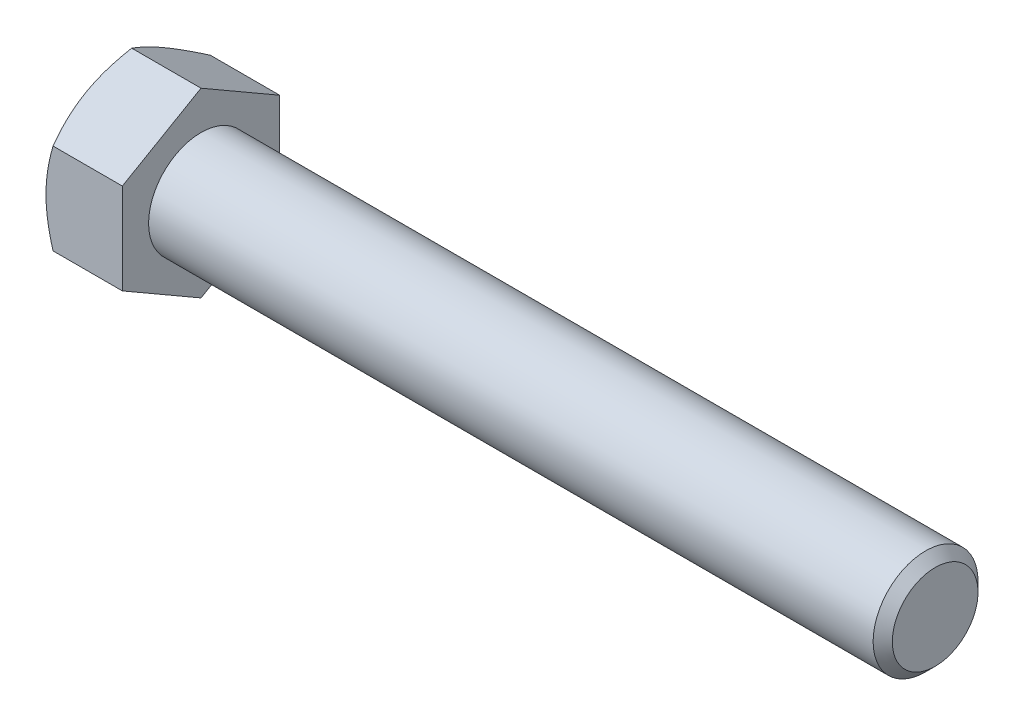
ISO-10303-21;
HEADER;
FILE_DESCRIPTION(('STEP AP214'),'2;1');
FILE_NAME('part.step','',(''),(''),'','','');
FILE_SCHEMA(('AUTOMOTIVE_DESIGN { 1 0 10303 214 1 1 1 1 }'));
ENDSEC;
DATA;
#1=APPLICATION_CONTEXT('core data for automotive mechanical design processes');
#2=APPLICATION_PROTOCOL_DEFINITION('international standard','automotive_design',2000,#1);
#3=PRODUCT_CONTEXT('',#1,'mechanical');
#4=PRODUCT('Part','Part','',(#3));
#5=PRODUCT_RELATED_PRODUCT_CATEGORY('part','',(#4));
#6=PRODUCT_DEFINITION_FORMATION('','',#4);
#7=PRODUCT_DEFINITION_CONTEXT('part definition',#1,'design');
#8=PRODUCT_DEFINITION('design','',#6,#7);
#9=PRODUCT_DEFINITION_SHAPE('','',#8);
#10=(LENGTH_UNIT() NAMED_UNIT(*) SI_UNIT(.MILLI.,.METRE.));
#11=(NAMED_UNIT(*) PLANE_ANGLE_UNIT() SI_UNIT($,.RADIAN.));
#12=(NAMED_UNIT(*) SI_UNIT($,.STERADIAN.) SOLID_ANGLE_UNIT());
#13=UNCERTAINTY_MEASURE_WITH_UNIT(LENGTH_MEASURE(1.E-05),#10,'distance_accuracy_value','');
#14=(GEOMETRIC_REPRESENTATION_CONTEXT(3) GLOBAL_UNCERTAINTY_ASSIGNED_CONTEXT((#13)) GLOBAL_UNIT_ASSIGNED_CONTEXT((#10,
#11,#12)) REPRESENTATION_CONTEXT('',''));
#15=CARTESIAN_POINT('',(0.,0.,0.));
#16=DIRECTION('',(0.,0.,1.));
#17=DIRECTION('',(1.,0.,0.));
#18=AXIS2_PLACEMENT_3D('',#15,#16,#17);
#19=CARTESIAN_POINT('',(9.2456,5.49926131403118,-9.525));
#20=DIRECTION('',(0.,-0.866025403784438,0.500000000000001));
#21=DIRECTION('',(0.,-0.500000000000001,-0.866025403784438));
#22=AXIS2_PLACEMENT_3D('',#19,#20,#21);
#23=PLANE('',#22);
#24=CARTESIAN_POINT('',(0.85080535368533,10.9986380981162,0.000199999999999971));
#25=CARTESIAN_POINT('',(0.781023201247645,10.8777523132173,-0.209180321357816));
#26=CARTESIAN_POINT('',(0.714408233957867,10.7564158029679,-0.419341321922845));
#27=CARTESIAN_POINT('',(0.588391469790018,10.5127697532954,-0.841348659019075));
#28=CARTESIAN_POINT('',(0.52899204530977,10.3904599078574,-1.05319552558363));
#29=CARTESIAN_POINT('',(0.362766604707591,10.0215595864394,-1.69214962520807));
#30=CARTESIAN_POINT('',(0.268218329918821,9.77351282584137,-2.12177921721668));
#31=CARTESIAN_POINT('',(0.15735162884543,9.40232220358294,-2.76470023426138));
#32=CARTESIAN_POINT('',(0.125769866148954,9.28028730086356,-2.97607088606807));
#33=CARTESIAN_POINT('',(0.0728092531292037,9.03565248016184,-3.39979082482396));
#34=CARTESIAN_POINT('',(0.0514305991810313,8.91305255135051,-3.61214013052951));
#35=CARTESIAN_POINT('',(0.0194239766724808,8.66764818787802,-4.03719295646296));
#36=CARTESIAN_POINT('',(0.00878323258550093,8.54484417077186,-4.24989575346438));
#37=CARTESIAN_POINT('',(-0.00152146504907578,8.29912270270345,-4.67549782066928));
#38=CARTESIAN_POINT('',(-0.00118575773535255,8.17620525536319,-4.88839708459929));
#39=CARTESIAN_POINT('',(0.00969884023177677,7.94640807689151,-5.28641747314821));
#40=CARTESIAN_POINT('',(0.0189199445075649,7.83951212670956,-5.4715666899867));
#41=CARTESIAN_POINT('',(0.0454848010115634,7.62597023317658,-5.84143209913029));
#42=CARTESIAN_POINT('',(0.0628291278252524,7.5193243080471,-6.02614825987472));
#43=CARTESIAN_POINT('',(0.126636878025746,7.19979976097279,-6.57958100967286));
#44=CARTESIAN_POINT('',(0.184867121471556,6.98748672019118,-6.94731798341605));
#45=CARTESIAN_POINT('',(0.330443291970772,6.56060850831896,-7.68669273502289));
#46=CARTESIAN_POINT('',(0.418406296346446,6.3460978161353,-8.05823615265175));
#47=CARTESIAN_POINT('',(0.618045797355982,5.92027529884847,-8.79578238759942));
#48=CARTESIAN_POINT('',(0.729675405460142,5.70895802095901,-9.16179464942112));
#49=CARTESIAN_POINT('',(0.850805353685325,5.49914584397734,-9.5252));
#50=B_SPLINE_CURVE_WITH_KNOTS('',3,(#24,#25,#26,#27,#28,#29,#30,#31,#32,#33,#34,#35,#36,#37,#38,
#39,#40,#41,#42,#43,#44,#45,#46,#47,#48,#49),.UNSPECIFIED.,.F.,.F.,(4,2,2,2,2,2,2,2,2,2,2,2,4),
(0.,0.754861746958002,1.50997101692211,3.02340406075151,3.76154608748042,4.49970232035706,
5.23697928598072,5.97423347202913,6.61604550518408,7.25790294292823,8.54252993638601,
9.85564695316764,11.1661863217647),.UNSPECIFIED.);
#51=CARTESIAN_POINT('',(0.850738685968806,10.9985226280624,0.));
#52=VERTEX_POINT('',#51);
#53=CARTESIAN_POINT('',(0.,8.24889197104677,-4.76250000000001));
#54=VERTEX_POINT('',#53);
#55=EDGE_CURVE('E49',#52,#54,#50,.T.);
#56=ORIENTED_EDGE('',*,*,#55,.F.);
#57=DIRECTION('',(-1.,0.,0.));
#58=VECTOR('',#57,1.);
#59=CARTESIAN_POINT('',(9.2456,10.9985226280624,0.));
#60=LINE('',#59,#58);
#61=CARTESIAN_POINT('',(9.2456,10.9985226280624,0.));
#62=VERTEX_POINT('',#61);
#63=EDGE_CURVE('E145',#62,#52,#60,.T.);
#64=ORIENTED_EDGE('',*,*,#63,.F.);
#65=DIRECTION('',(0.,0.500000000000001,0.866025403784438));
#66=VECTOR('',#65,1.);
#67=CARTESIAN_POINT('',(9.2456,5.49926131403118,-9.525));
#68=LINE('',#67,#66);
#69=CARTESIAN_POINT('',(9.2456,5.49926131403118,-9.525));
#70=VERTEX_POINT('',#69);
#71=EDGE_CURVE('E230',#70,#62,#68,.T.);
#72=ORIENTED_EDGE('',*,*,#71,.F.);
#73=DIRECTION('',(-1.,0.,0.));
#74=VECTOR('',#73,1.);
#75=CARTESIAN_POINT('',(9.2456,5.49926131403118,-9.525));
#76=LINE('',#75,#74);
#77=CARTESIAN_POINT('',(0.850738685968801,5.49926131403118,-9.525));
#78=VERTEX_POINT('',#77);
#79=EDGE_CURVE('E133',#70,#78,#76,.T.);
#80=ORIENTED_EDGE('',*,*,#79,.T.);
#81=EDGE_CURVE('E127',#54,#78,#50,.T.);
#82=ORIENTED_EDGE('',*,*,#81,.F.);
#83=EDGE_LOOP('',(#56,#64,#72,#80,#82));
#84=FACE_BOUND('',#83,.T.);
#85=ADVANCED_FACE('F33',(#84),#23,.F.);
#86=CARTESIAN_POINT('',(9.2456,10.9985226280624,0.));
#87=DIRECTION('',(0.,-0.866025403784438,-0.500000000000001));
#88=DIRECTION('',(0.,0.500000000000001,-0.866025403784438));
#89=AXIS2_PLACEMENT_3D('',#86,#87,#88);
#90=PLANE('',#89);
#91=CARTESIAN_POINT('',(0.850805353685325,5.49914584397734,9.5252));
#92=CARTESIAN_POINT('',(0.781023201247641,5.62003162887629,9.31581967864219));
#93=CARTESIAN_POINT('',(0.714408233957864,5.74136813912567,9.10565867807716));
#94=CARTESIAN_POINT('',(0.588391469790016,5.98501418879817,8.68365134098093));
#95=CARTESIAN_POINT('',(0.528992045309767,6.1073240342362,8.47180447441637));
#96=CARTESIAN_POINT('',(0.362766604707589,6.47622435565418,7.83285037479193));
#97=CARTESIAN_POINT('',(0.26821832991882,6.72427111625218,7.40322078278333));
#98=CARTESIAN_POINT('',(0.157351628845429,7.09546173851061,6.76029976573862));
#99=CARTESIAN_POINT('',(0.125769866148952,7.21749664122999,6.54892911393194));
#100=CARTESIAN_POINT('',(0.0728092531292026,7.46213146193172,6.12520917517604));
#101=CARTESIAN_POINT('',(0.051430599181031,7.58473139074304,5.91285986947049));
#102=CARTESIAN_POINT('',(0.0194239766724812,7.83013575421553,5.48780704353705));
#103=CARTESIAN_POINT('',(0.00878323258550119,7.95293977132169,5.27510424653562));
#104=CARTESIAN_POINT('',(-0.00152146504907555,8.1986612393901,4.84950217933073));
#105=CARTESIAN_POINT('',(-0.00118575773535221,8.32157868673036,4.63660291540072));
#106=CARTESIAN_POINT('',(0.00969884023177741,8.55137586520205,4.23858252685179));
#107=CARTESIAN_POINT('',(0.0189199445075657,8.65827181538399,4.05343331001331));
#108=CARTESIAN_POINT('',(0.0454848010115646,8.87181370891697,3.68356790086972));
#109=CARTESIAN_POINT('',(0.0628291278252538,8.97845963404645,3.49885174012528));
#110=CARTESIAN_POINT('',(0.126636878025748,9.29798418112076,2.94541899032714));
#111=CARTESIAN_POINT('',(0.184867121471557,9.51029722190237,2.57768201658396));
#112=CARTESIAN_POINT('',(0.330443291970774,9.93717543377459,1.83830726497712));
#113=CARTESIAN_POINT('',(0.418406296346449,10.1516861259583,1.46676384734825));
#114=CARTESIAN_POINT('',(0.618045797355987,10.5775086432451,0.729217612400587));
#115=CARTESIAN_POINT('',(0.729675405460147,10.7888259211345,0.363205350578885));
#116=CARTESIAN_POINT('',(0.85080535368533,10.9986380981162,-0.000200000000000311));
#117=B_SPLINE_CURVE_WITH_KNOTS('',3,(#91,#92,#93,#94,#95,#96,#97,#98,#99,#100,#101,#102,#103,
#104,#105,#106,#107,#108,#109,#110,#111,#112,#113,#114,#115,#116),.UNSPECIFIED.,.F.,.F.,(4,2,2,
2,2,2,2,2,2,2,2,2,4),(0.,0.754861746958001,1.50997101692211,3.0234040607515,3.76154608748041,
4.49970232035706,5.23697928598071,5.97423347202912,6.61604550518407,7.25790294292823,
8.54252993638601,9.85564695316763,11.1661863217647),.UNSPECIFIED.);
#118=CARTESIAN_POINT('',(0.850738685968801,5.49926131403118,9.525));
#119=VERTEX_POINT('',#118);
#120=CARTESIAN_POINT('',(0.,8.24889197104677,4.76250000000001));
#121=VERTEX_POINT('',#120);
#122=EDGE_CURVE('E56',#119,#121,#117,.T.);
#123=ORIENTED_EDGE('',*,*,#122,.F.);
#124=DIRECTION('',(-1.,0.,0.));
#125=VECTOR('',#124,1.);
#126=CARTESIAN_POINT('',(9.2456,5.49926131403118,9.525));
#127=LINE('',#126,#125);
#128=CARTESIAN_POINT('',(9.2456,5.49926131403118,9.525));
#129=VERTEX_POINT('',#128);
#130=EDGE_CURVE('E143',#129,#119,#127,.T.);
#131=ORIENTED_EDGE('',*,*,#130,.F.);
#132=DIRECTION('',(0.,-0.500000000000001,0.866025403784438));
#133=VECTOR('',#132,1.);
#134=CARTESIAN_POINT('',(9.2456,10.9985226280624,0.));
#135=LINE('',#134,#133);
#136=EDGE_CURVE('E228',#62,#129,#135,.T.);
#137=ORIENTED_EDGE('',*,*,#136,.F.);
#138=ORIENTED_EDGE('',*,*,#63,.T.);
#139=EDGE_CURVE('E160',#121,#52,#117,.T.);
#140=ORIENTED_EDGE('',*,*,#139,.F.);
#141=EDGE_LOOP('',(#123,#131,#137,#138,#140));
#142=FACE_BOUND('',#141,.T.);
#143=ADVANCED_FACE('F166',(#142),#90,.F.);
#144=CARTESIAN_POINT('',(9.2456,5.49926131403118,9.525));
#145=DIRECTION('',(0.,0.,-1.));
#146=DIRECTION('',(-1.,0.,0.));
#147=AXIS2_PLACEMENT_3D('',#144,#145,#146);
#148=PLANE('',#147);
#149=CARTESIAN_POINT('',(4.65297862020096,-14.7810115366526,9.525));
#150=CARTESIAN_POINT('',(4.55200114697969,-14.5729402848548,9.525));
#151=CARTESIAN_POINT('',(4.45152657852495,-14.3646250845143,9.525));
#152=CARTESIAN_POINT('',(4.25169715270379,-13.9474558848886,9.525));
#153=CARTESIAN_POINT('',(4.15234230655454,-13.7386018802315,9.525));
#154=CARTESIAN_POINT('',(3.85610205085232,-13.1110997604408,9.525));
#155=CARTESIAN_POINT('',(3.66107082946317,-12.6915729928092,9.525));
#156=CARTESIAN_POINT('',(3.27608312845872,-11.8474364819289,9.525));
#157=CARTESIAN_POINT('',(3.08615996520328,-11.4228115070931,9.525));
#158=CARTESIAN_POINT('',(2.7140723816763,-10.5701875182868,9.525));
#159=CARTESIAN_POINT('',(2.53190759510785,-10.1421886647409,9.525));
#160=CARTESIAN_POINT('',(2.17173180421227,-9.26840827793762,9.525));
#161=CARTESIAN_POINT('',(1.9940386576054,-8.82249500065039,9.525));
#162=CARTESIAN_POINT('',(1.65207801715251,-7.92545654404829,9.525));
#163=CARTESIAN_POINT('',(1.48781202814775,-7.47433078699668,9.525));
#164=CARTESIAN_POINT('',(1.17701101312694,-6.56698486643262,9.525));
#165=CARTESIAN_POINT('',(1.03044020737988,-6.11077709183234,9.525));
#166=CARTESIAN_POINT('',(0.759723980462389,-5.19183461770946,9.525));
#167=CARTESIAN_POINT('',(0.635571508908761,-4.72910201971934,9.525));
#168=CARTESIAN_POINT('',(0.416296039044823,-3.79927533749824,9.525));
#169=CARTESIAN_POINT('',(0.321019170056993,-3.33221854628569,9.525));
#170=CARTESIAN_POINT('',(0.203895327456017,-2.62737339603034,9.525));
#171=CARTESIAN_POINT('',(0.169151073901592,-2.39169815065082,9.525));
#172=CARTESIAN_POINT('',(0.108940898325767,-1.91917305353182,9.525));
#173=CARTESIAN_POINT('',(0.0834740799106706,-1.68232331751526,9.525));
#174=CARTESIAN_POINT('',(0.0426462139382907,-1.21086692666172,9.525));
#175=CARTESIAN_POINT('',(0.0271575476697085,-0.976271367216093,9.525));
#176=CARTESIAN_POINT('',(0.00611497588533444,-0.506635508477948,9.525));
#177=CARTESIAN_POINT('',(0.000560905150695456,-0.271595216646694,9.525));
#178=CARTESIAN_POINT('',(-0.000479967131791387,0.198511625361333,9.525));
#179=CARTESIAN_POINT('',(0.00403333600034549,0.433578175785727,9.525));
#180=CARTESIAN_POINT('',(0.0230169602197956,0.903311845567768,9.525));
#181=CARTESIAN_POINT('',(0.0374877771856479,1.13797894444949,9.525));
#182=CARTESIAN_POINT('',(0.0838926002328695,1.70156520102241,9.525));
#183=CARTESIAN_POINT('',(0.120529196491428,2.03010533257162,9.525));
#184=CARTESIAN_POINT('',(0.211324091565227,2.68473880457707,9.525));
#185=CARTESIAN_POINT('',(0.265484757377356,3.0108318084053,9.525));
#186=CARTESIAN_POINT('',(0.451380100896851,3.98506326209964,9.525));
#187=CARTESIAN_POINT('',(0.606495020219102,4.62879899939557,9.525));
#188=CARTESIAN_POINT('',(0.875429330956877,5.59158230732318,9.525));
#189=CARTESIAN_POINT('',(0.972405254059032,5.91562142468824,9.525));
#190=CARTESIAN_POINT('',(1.1764087393435,6.56055109397588,9.525));
#191=CARTESIAN_POINT('',(1.28343637307408,6.8814416234688,9.525));
#192=CARTESIAN_POINT('',(1.50582732440542,7.5201782599988,9.525));
#193=CARTESIAN_POINT('',(1.62118794476215,7.83802531476313,9.525));
#194=CARTESIAN_POINT('',(1.8588892326368,8.47108431720186,9.525));
#195=CARTESIAN_POINT('',(1.98122977973554,8.7862963102294,9.525));
#196=CARTESIAN_POINT('',(2.3006347745931,9.58716274310348,9.525));
#197=CARTESIAN_POINT('',(2.5017818490006,10.0711868007297,9.525));
#198=CARTESIAN_POINT('',(2.91473175900993,11.0346830906918,9.525));
#199=CARTESIAN_POINT('',(3.12653548923491,11.514154936841,9.525));
#200=CARTESIAN_POINT('',(3.55844219486127,12.469507207548,9.525));
#201=CARTESIAN_POINT('',(3.77854763045353,12.9453865165196,9.525));
#202=CARTESIAN_POINT('',(4.22520690131798,13.8940827737158,9.525));
#203=CARTESIAN_POINT('',(4.45176054207861,14.3668998137874,9.525));
#204=CARTESIAN_POINT('',(4.91030379081785,15.3106675427801,9.525));
#205=CARTESIAN_POINT('',(5.14230026383003,15.7816148898187,9.525));
#206=CARTESIAN_POINT('',(5.61043419198847,16.7214473380243,9.525));
#207=CARTESIAN_POINT('',(5.84657167244604,17.1903324265641,9.525));
#208=CARTESIAN_POINT('',(6.3221778120835,18.126306589971,9.525));
#209=CARTESIAN_POINT('',(6.5616458906658,18.5933959601918,9.525));
#210=CARTESIAN_POINT('',(7.04336394052906,19.5261387749103,9.525));
#211=CARTESIAN_POINT('',(7.28561392258584,19.9917922138369,9.525));
#212=CARTESIAN_POINT('',(7.96929589667502,21.298052573243,9.525));
#213=CARTESIAN_POINT('',(8.4133455052885,22.1372892881281,9.525));
#214=CARTESIAN_POINT('',(9.30698696570732,23.8128512402401,9.525));
#215=CARTESIAN_POINT('',(9.75657908064905,24.6491763367987,9.525));
#216=CARTESIAN_POINT('',(10.6586387715905,26.3171534675354,9.525));
#217=CARTESIAN_POINT('',(11.1110942984919,27.148812022257,9.525));
#218=CARTESIAN_POINT('',(11.7921739160346,28.3949535333841,9.525));
#219=CARTESIAN_POINT('',(12.0195924712891,28.8100962856009,9.525));
#220=CARTESIAN_POINT('',(12.4751463020886,29.6399876727053,9.525));
#221=CARTESIAN_POINT('',(12.7032815766791,30.0547363081168,9.525));
#222=CARTESIAN_POINT('',(12.9317320980144,30.4693112732241,9.525));
#223=B_SPLINE_CURVE_WITH_KNOTS('',3,(#149,#150,#151,#152,#153,#154,#155,#156,#157,#158,#159,
#160,#161,#162,#163,#164,#165,#166,#167,#168,#169,#170,#171,#172,#173,#174,#175,#176,#177,#178,
#179,#180,#181,#182,#183,#184,#185,#186,#187,#188,#189,#190,#191,#192,#193,#194,#195,#196,#197,
#198,#199,#200,#201,#202,#203,#204,#205,#206,#207,#208,#209,#210,#211,#212,#213,#214,#215,#216,
#217,#218,#219,#220,#221,#222),.UNSPECIFIED.,.F.,.F.,(4,2,2,2,2,2,2,2,2,2,2,2,2,2,2,2,2,2,2,2,2,
2,2,2,2,2,2,2,2,2,2,2,2,2,2,2,4),(0.,0.693836530044208,1.38768000463458,2.77557197297935,
4.17100213114403,5.56636633354267,7.00624082823087,8.44627647542748,9.88334978435084,
11.3199703553044,12.748795200913,13.4633089947651,14.1777537333629,14.882869257303,
15.5879730545998,16.2930841835603,16.9982304291963,17.9894005549206,18.9807046150987,
20.9643780182785,21.9790105644811,22.9936503334044,24.0079631400217,25.022258452787,
26.5945433127103,28.1669603864419,29.7398471611298,31.3126865395143,32.8876294963396,
34.4625820831343,36.0372634785707,37.6119509756548,40.460336959425,43.3088586981742,
46.1491565485714,47.5692138965971,48.9892693539119),.UNSPECIFIED.);
#224=CARTESIAN_POINT('',(0.850738685968808,-5.4992613140312,9.525));
#225=VERTEX_POINT('',#224);
#226=CARTESIAN_POINT('',(0.,0.,9.525));
#227=VERTEX_POINT('',#226);
#228=EDGE_CURVE('E240',#225,#227,#223,.T.);
#229=ORIENTED_EDGE('',*,*,#228,.F.);
#230=DIRECTION('',(-1.,0.,0.));
#231=VECTOR('',#230,1.);
#232=CARTESIAN_POINT('',(9.2456,-5.4992613140312,9.525));
#233=LINE('',#232,#231);
#234=CARTESIAN_POINT('',(9.2456,-5.4992613140312,9.525));
#235=VERTEX_POINT('',#234);
#236=EDGE_CURVE('E135',#235,#225,#233,.T.);
#237=ORIENTED_EDGE('',*,*,#236,.F.);
#238=DIRECTION('',(0.,-1.,0.));
#239=VECTOR('',#238,1.);
#240=CARTESIAN_POINT('',(9.2456,5.49926131403118,9.525));
#241=LINE('',#240,#239);
#242=EDGE_CURVE('E224',#129,#235,#241,.T.);
#243=ORIENTED_EDGE('',*,*,#242,.F.);
#244=ORIENTED_EDGE('',*,*,#130,.T.);
#245=EDGE_CURVE('E182',#227,#119,#223,.T.);
#246=ORIENTED_EDGE('',*,*,#245,.F.);
#247=EDGE_LOOP('',(#229,#237,#243,#244,#246));
#248=FACE_BOUND('',#247,.T.);
#249=ADVANCED_FACE('F246',(#248),#148,.F.);
#250=CARTESIAN_POINT('',(9.2456,-10.9985226280624,0.));
#251=DIRECTION('',(0.,0.866025403784438,-0.500000000000001));
#252=DIRECTION('',(0.,0.500000000000001,0.866025403784438));
#253=AXIS2_PLACEMENT_3D('',#250,#251,#252);
#254=PLANE('',#253);
#255=CARTESIAN_POINT('',(0.850805353685344,-10.9986380981162,-0.000199999999999715));
#256=CARTESIAN_POINT('',(0.781023201247659,-10.8777523132173,0.209180321357816));
#257=CARTESIAN_POINT('',(0.714408233957881,-10.7564158029679,0.419341321922846));
#258=CARTESIAN_POINT('',(0.588391469790032,-10.5127697532954,0.841348659019077));
#259=CARTESIAN_POINT('',(0.528992045309783,-10.3904599078574,1.05319552558363));
#260=CARTESIAN_POINT('',(0.362766604707605,-10.0215595864394,1.69214962520808));
#261=CARTESIAN_POINT('',(0.268218329918836,-9.77351282584139,2.12177921721668));
#262=CARTESIAN_POINT('',(0.157351628845443,-9.40232220358296,2.76470023426139));
#263=CARTESIAN_POINT('',(0.125769866148966,-9.28028730086359,2.97607088606807));
#264=CARTESIAN_POINT('',(0.0728092531292156,-9.03565248016186,3.39979082482397));
#265=CARTESIAN_POINT('',(0.0514305991810436,-8.91305255135053,3.61214013052952));
#266=CARTESIAN_POINT('',(0.0194239766724933,-8.66764818787804,4.03719295646297));
#267=CARTESIAN_POINT('',(0.00878323258551298,-8.54484417077188,4.24989575346439));
#268=CARTESIAN_POINT('',(-0.0015214650490643,-8.29912270270347,4.67549782066929));
#269=CARTESIAN_POINT('',(-0.00118575773534124,-8.17620525536321,4.8883970845993));
#270=CARTESIAN_POINT('',(0.00969884023178796,-7.94640807689153,5.28641747314822));
#271=CARTESIAN_POINT('',(0.0189199445075761,-7.83951212670958,5.4715666899867));
#272=CARTESIAN_POINT('',(0.0454848010115746,-7.6259702331766,5.84143209913029));
#273=CARTESIAN_POINT('',(0.0628291278252637,-7.51932430804712,6.02614825987473));
#274=CARTESIAN_POINT('',(0.126636878025757,-7.19979976097281,6.57958100967287));
#275=CARTESIAN_POINT('',(0.184867121471566,-6.9874867201912,6.94731798341605));
#276=CARTESIAN_POINT('',(0.330443291970781,-6.56060850831898,7.68669273502289));
#277=CARTESIAN_POINT('',(0.418406296346454,-6.34609781613532,8.05823615265176));
#278=CARTESIAN_POINT('',(0.618045797355989,-5.9202752988485,8.79578238759941));
#279=CARTESIAN_POINT('',(0.729675405460148,-5.70895802095903,9.16179464942111));
#280=CARTESIAN_POINT('',(0.850805353685331,-5.49914584397736,9.5252));
#281=B_SPLINE_CURVE_WITH_KNOTS('',3,(#255,#256,#257,#258,#259,#260,#261,#262,#263,#264,#265,
#266,#267,#268,#269,#270,#271,#272,#273,#274,#275,#276,#277,#278,#279,#280),.UNSPECIFIED.,.F.,
.F.,(4,2,2,2,2,2,2,2,2,2,2,2,4),(0.,0.754861746958002,1.50997101692212,3.02340406075151,
3.76154608748043,4.49970232035707,5.23697928598073,5.97423347202913,6.61604550518408,
7.25790294292824,8.54252993638602,9.85564695316764,11.1661863217647),.UNSPECIFIED.);
#282=CARTESIAN_POINT('',(0.85073868596882,-10.9985226280624,0.));
#283=VERTEX_POINT('',#282);
#284=CARTESIAN_POINT('',(0.,-8.24889197104677,4.76250000000001));
#285=VERTEX_POINT('',#284);
#286=EDGE_CURVE('E168',#283,#285,#281,.T.);
#287=ORIENTED_EDGE('',*,*,#286,.F.);
#288=DIRECTION('',(-1.,0.,0.));
#289=VECTOR('',#288,1.);
#290=CARTESIAN_POINT('',(9.2456,-10.9985226280624,0.));
#291=LINE('',#290,#289);
#292=CARTESIAN_POINT('',(9.2456,-10.9985226280624,0.));
#293=VERTEX_POINT('',#292);
#294=EDGE_CURVE('E132',#293,#283,#291,.T.);
#295=ORIENTED_EDGE('',*,*,#294,.F.);
#296=DIRECTION('',(0.,-0.500000000000001,-0.866025403784438));
#297=VECTOR('',#296,1.);
#298=CARTESIAN_POINT('',(9.2456,-10.9985226280624,0.));
#299=LINE('',#298,#297);
#300=EDGE_CURVE('E222',#235,#293,#299,.T.);
#301=ORIENTED_EDGE('',*,*,#300,.F.);
#302=ORIENTED_EDGE('',*,*,#236,.T.);
#303=EDGE_CURVE('E170',#285,#225,#281,.T.);
#304=ORIENTED_EDGE('',*,*,#303,.F.);
#305=EDGE_LOOP('',(#287,#295,#301,#302,#304));
#306=FACE_BOUND('',#305,.T.);
#307=ADVANCED_FACE('F218',(#306),#254,.F.);
#308=CARTESIAN_POINT('',(9.2456,-5.4992613140312,-9.525));
#309=DIRECTION('',(0.,0.866025403784438,0.500000000000001));
#310=DIRECTION('',(0.,-0.500000000000001,0.866025403784438));
#311=AXIS2_PLACEMENT_3D('',#308,#309,#310);
#312=PLANE('',#311);
#313=CARTESIAN_POINT('',(0.850805353685333,-5.49914584397736,-9.5252));
#314=CARTESIAN_POINT('',(0.781023201247649,-5.62003162887631,-9.31581967864219));
#315=CARTESIAN_POINT('',(0.714408233957872,-5.74136813912569,-9.10565867807716));
#316=CARTESIAN_POINT('',(0.588391469790023,-5.9850141887982,-8.68365134098093));
#317=CARTESIAN_POINT('',(0.528992045309774,-6.10732403423622,-8.47180447441637));
#318=CARTESIAN_POINT('',(0.362766604707596,-6.47622435565421,-7.83285037479193));
#319=CARTESIAN_POINT('',(0.268218329918829,-6.72427111625221,-7.40322078278332));
#320=CARTESIAN_POINT('',(0.157351628845438,-7.09546173851064,-6.76029976573862));
#321=CARTESIAN_POINT('',(0.125769866148962,-7.21749664123001,-6.54892911393193));
#322=CARTESIAN_POINT('',(0.0728092531292128,-7.46213146193174,-6.12520917517604));
#323=CARTESIAN_POINT('',(0.0514305991810416,-7.58473139074307,-5.91285986947049));
#324=CARTESIAN_POINT('',(0.0194239766724923,-7.83013575421556,-5.48780704353704));
#325=CARTESIAN_POINT('',(0.00878323258551245,-7.95293977132172,-5.27510424653562));
#326=CARTESIAN_POINT('',(-0.00152146504906375,-8.19866123939013,-4.84950217933072));
#327=CARTESIAN_POINT('',(-0.00118575773534007,-8.32157868673039,-4.63660291540071));
#328=CARTESIAN_POINT('',(0.00969884023179024,-8.55137586520207,-4.23858252685178));
#329=CARTESIAN_POINT('',(0.0189199445075789,-8.65827181538402,-4.0534333100133));
#330=CARTESIAN_POINT('',(0.0454848010115783,-8.871813708917,-3.68356790086971));
#331=CARTESIAN_POINT('',(0.0628291278252677,-8.97845963404648,-3.49885174012528));
#332=CARTESIAN_POINT('',(0.126636878025763,-9.29798418112079,-2.94541899032714));
#333=CARTESIAN_POINT('',(0.184867121471573,-9.51029722190239,-2.57768201658395));
#334=CARTESIAN_POINT('',(0.33044329197079,-9.93717543377462,-1.83830726497711));
#335=CARTESIAN_POINT('',(0.418406296346464,-10.1516861259583,-1.46676384734824));
#336=CARTESIAN_POINT('',(0.618045797356,-10.5775086432451,-0.729217612400584));
#337=CARTESIAN_POINT('',(0.72967540546016,-10.7888259211346,-0.363205350578884));
#338=CARTESIAN_POINT('',(0.850805353685344,-10.9986380981162,0.000200000000001608));
#339=B_SPLINE_CURVE_WITH_KNOTS('',3,(#313,#314,#315,#316,#317,#318,#319,#320,#321,#322,#323,
#324,#325,#326,#327,#328,#329,#330,#331,#332,#333,#334,#335,#336,#337,#338),.UNSPECIFIED.,.F.,
.F.,(4,2,2,2,2,2,2,2,2,2,2,2,4),(0.,0.754861746958002,1.50997101692212,3.02340406075151,
3.76154608748042,4.49970232035707,5.23697928598072,5.97423347202913,6.61604550518408,
7.25790294292824,8.54252993638602,9.85564695316764,11.1661863217647),.UNSPECIFIED.);
#340=CARTESIAN_POINT('',(0.850738685968808,-5.4992613140312,-9.525));
#341=VERTEX_POINT('',#340);
#342=CARTESIAN_POINT('',(0.,-8.24889197104677,-4.76250000000001));
#343=VERTEX_POINT('',#342);
#344=EDGE_CURVE('E109',#341,#343,#339,.T.);
#345=ORIENTED_EDGE('',*,*,#344,.F.);
#346=DIRECTION('',(-1.,0.,0.));
#347=VECTOR('',#346,1.);
#348=CARTESIAN_POINT('',(9.2456,-5.4992613140312,-9.525));
#349=LINE('',#348,#347);
#350=CARTESIAN_POINT('',(9.2456,-5.4992613140312,-9.525));
#351=VERTEX_POINT('',#350);
#352=EDGE_CURVE('E123',#351,#341,#349,.T.);
#353=ORIENTED_EDGE('',*,*,#352,.F.);
#354=DIRECTION('',(0.,0.500000000000001,-0.866025403784438));
#355=VECTOR('',#354,1.);
#356=CARTESIAN_POINT('',(9.2456,-5.4992613140312,-9.525));
#357=LINE('',#356,#355);
#358=EDGE_CURVE('E220',#293,#351,#357,.T.);
#359=ORIENTED_EDGE('',*,*,#358,.F.);
#360=ORIENTED_EDGE('',*,*,#294,.T.);
#361=EDGE_CURVE('E126',#343,#283,#339,.T.);
#362=ORIENTED_EDGE('',*,*,#361,.F.);
#363=EDGE_LOOP('',(#345,#353,#359,#360,#362));
#364=FACE_BOUND('',#363,.T.);
#365=ADVANCED_FACE('F121',(#364),#312,.F.);
#366=CARTESIAN_POINT('',(9.2456,5.49926131403118,-9.525));
#367=DIRECTION('',(0.,0.,1.));
#368=DIRECTION('',(0.,-1.,0.));
#369=AXIS2_PLACEMENT_3D('',#366,#367,#368);
#370=PLANE('',#369);
#371=CARTESIAN_POINT('',(4.65297862037684,-14.781011537015,-9.525));
#372=CARTESIAN_POINT('',(4.55200114715189,-14.5729402852111,-9.525));
#373=CARTESIAN_POINT('',(4.45152657869347,-14.3646250848645,-9.525));
#374=CARTESIAN_POINT('',(4.25169715286495,-13.9474558852266,-9.525));
#375=CARTESIAN_POINT('',(4.15234230671202,-13.7386018805634,-9.525));
#376=CARTESIAN_POINT('',(3.8561020509988,-13.1110997607544,-9.525));
#377=CARTESIAN_POINT('',(3.66107082960233,-12.6915729931106,-9.525));
#378=CARTESIAN_POINT('',(3.27608312858322,-11.8474364822057,-9.525));
#379=CARTESIAN_POINT('',(3.08615996532045,-11.4228115073574,-9.525));
#380=CARTESIAN_POINT('',(2.71407238177894,-10.5701875185262,-9.525));
#381=CARTESIAN_POINT('',(2.53190759520328,-10.1421886649677,-9.525));
#382=CARTESIAN_POINT('',(2.17173180429311,-9.26840827813855,-9.525));
#383=CARTESIAN_POINT('',(1.99403865767888,-8.82249500083789,-9.525));
#384=CARTESIAN_POINT('',(1.65207801721166,-7.92545654420872,-9.525));
#385=CARTESIAN_POINT('',(1.48781202819994,-7.47433078714345,-9.525));
#386=CARTESIAN_POINT('',(1.17701101316587,-6.56698486655185,-9.525));
#387=CARTESIAN_POINT('',(1.03044020741253,-6.11077709193767,-9.525));
#388=CARTESIAN_POINT('',(0.759723980483498,-5.19183461778659,-9.525));
#389=CARTESIAN_POINT('',(0.635571508924623,-4.7291020197822,-9.525));
#390=CARTESIAN_POINT('',(0.41629603905012,-3.79927533752507,-9.525));
#391=CARTESIAN_POINT('',(0.321019170057394,-3.33221854629066,-9.525));
#392=CARTESIAN_POINT('',(0.203895327451552,-2.62737339600217,-9.525));
#393=CARTESIAN_POINT('',(0.169151073895918,-2.39169815061155,-9.525));
#394=CARTESIAN_POINT('',(0.108940898318591,-1.91917305347024,-9.525));
#395=CARTESIAN_POINT('',(0.0834740799032008,-1.68232331744248,-9.525));
#396=CARTESIAN_POINT('',(0.0426462139312212,-1.21086692656677,-9.525));
#397=CARTESIAN_POINT('',(0.0271575476633154,-0.976271367110181,-9.525));
#398=CARTESIAN_POINT('',(0.00611497588125655,-0.506635508350127,-9.525));
#399=CARTESIAN_POINT('',(0.00056090514825638,-0.271595216507932,-9.525));
#400=CARTESIAN_POINT('',(-0.000479967130014351,0.19851162552189,-9.525));
#401=CARTESIAN_POINT('',(0.00403333600469999,0.433578175957139,-9.525));
#402=CARTESIAN_POINT('',(0.023016960230171,0.903311845760747,-9.525));
#403=CARTESIAN_POINT('',(0.0374877771994669,1.13797894465318,-9.525));
#404=CARTESIAN_POINT('',(0.0838926002551644,1.70156520124285,-9.525));
#405=CARTESIAN_POINT('',(0.120529196518618,2.03010533279804,-9.525));
#406=CARTESIAN_POINT('',(0.211324091602472,2.68473880481519,-9.525));
#407=CARTESIAN_POINT('',(0.26548475741976,3.01083180864914,-9.525));
#408=CARTESIAN_POINT('',(0.451380100954847,3.98506326236033,-9.525));
#409=CARTESIAN_POINT('',(0.606495020287634,4.62879899966707,-9.525));
#410=CARTESIAN_POINT('',(0.875429331040972,5.59158230761085,-9.525));
#411=CARTESIAN_POINT('',(0.972405254148351,5.91562142498141,-9.525));
#412=CARTESIAN_POINT('',(1.17640873944312,6.56055109428,-9.525));
#413=CARTESIAN_POINT('',(1.28343637317877,6.88144162377837,-9.525));
#414=CARTESIAN_POINT('',(1.50582732452007,7.52017826031922,-9.525));
#415=CARTESIAN_POINT('',(1.6211879448817,7.83802531508895,-9.525));
#416=CARTESIAN_POINT('',(1.85888923276599,8.4710843175385,-9.525));
#417=CARTESIAN_POINT('',(1.98122977986946,8.78629631057145,-9.525));
#418=CARTESIAN_POINT('',(2.30063477473476,9.58716274344894,-9.525));
#419=CARTESIAN_POINT('',(2.50178184914486,10.0711868010733,-9.525));
#420=CARTESIAN_POINT('',(2.91473175915869,11.0346830910319,-9.525));
#421=CARTESIAN_POINT('',(3.12653548938558,11.5141549371795,-9.525));
#422=CARTESIAN_POINT('',(3.55844219501524,12.4695072078834,-9.525));
#423=CARTESIAN_POINT('',(3.77854763060888,12.9453865168535,-9.525));
#424=CARTESIAN_POINT('',(4.22520690147574,13.8940827740469,-9.525));
#425=CARTESIAN_POINT('',(4.45176054223739,14.3668998141172,-9.525));
#426=CARTESIAN_POINT('',(4.91030379097835,15.3106675431073,-9.525));
#427=CARTESIAN_POINT('',(5.14230026399124,15.7816148901447,-9.525));
#428=CARTESIAN_POINT('',(5.61043419215086,16.7214473383479,-9.525));
#429=CARTESIAN_POINT('',(5.84657167260892,17.1903324268865,-9.525));
#430=CARTESIAN_POINT('',(6.32217781224719,18.1263065902912,-9.525));
#431=CARTESIAN_POINT('',(6.56164589082982,18.593395960511,-9.525));
#432=CARTESIAN_POINT('',(7.04336394069362,19.5261387752273,-9.525));
#433=CARTESIAN_POINT('',(7.2856139227506,19.9917922141529,-9.525));
#434=CARTESIAN_POINT('',(7.96929589684106,21.2980525735579,-9.525));
#435=CARTESIAN_POINT('',(8.41334550545553,22.137289288443,-9.525));
#436=CARTESIAN_POINT('',(9.30698696587611,23.8128512405549,-9.525));
#437=CARTESIAN_POINT('',(9.75657908081864,24.6491763371135,-9.525));
#438=CARTESIAN_POINT('',(10.6586387717617,26.3171534678506,-9.525));
#439=CARTESIAN_POINT('',(11.1110942986638,27.1488120225725,-9.525));
#440=CARTESIAN_POINT('',(11.7921739162077,28.3949535337002,-9.525));
#441=CARTESIAN_POINT('',(12.0195924714625,28.8100962859173,-9.525));
#442=CARTESIAN_POINT('',(12.4751463022627,29.6399876730221,-9.525));
#443=CARTESIAN_POINT('',(12.7032815768535,30.0547363084338,-9.525));
#444=CARTESIAN_POINT('',(12.9317320981892,30.4693112735413,-9.525));
#445=B_SPLINE_CURVE_WITH_KNOTS('',3,(#371,#372,#373,#374,#375,#376,#377,#378,#379,#380,#381,
#382,#383,#384,#385,#386,#387,#388,#389,#390,#391,#392,#393,#394,#395,#396,#397,#398,#399,#400,
#401,#402,#403,#404,#405,#406,#407,#408,#409,#410,#411,#412,#413,#414,#415,#416,#417,#418,#419,
#420,#421,#422,#423,#424,#425,#426,#427,#428,#429,#430,#431,#432,#433,#434,#435,#436,#437,#438,
#439,#440,#441,#442,#443,#444),.UNSPECIFIED.,.F.,.F.,(4,2,2,2,2,2,2,2,2,2,2,2,2,2,2,2,2,2,2,2,2,
2,2,2,2,2,2,2,2,2,2,2,2,2,2,2,4),(0.,0.693836530065471,1.38768000467711,2.7755719730644,
4.17100213127208,5.56636633371373,7.00624082844752,8.44627647568974,9.88334978465856,
11.3199703556576,12.7487952013331,13.4633089952187,14.17775373385,14.8828692578227,
15.5879730551522,16.2930841841453,16.9982304298141,17.9894005555578,18.9807046157553,
20.9643780189742,21.979010565197,22.9936503341407,24.0079631407782,25.0222584535638,
26.5945433134849,28.1669603872144,29.7398471619,31.3126865402824,32.8876294971052,
34.4625820838974,36.0372634793315,37.6119509764132,40.4603369601845,43.308858698935,
46.1491565493342,47.5692138973609,48.9892693546768),.UNSPECIFIED.);
#446=CARTESIAN_POINT('',(0.,0.,-9.525));
#447=VERTEX_POINT('',#446);
#448=EDGE_CURVE('E115',#78,#447,#445,.F.);
#449=ORIENTED_EDGE('',*,*,#448,.F.);
#450=ORIENTED_EDGE('',*,*,#79,.F.);
#451=DIRECTION('',(0.,1.,0.));
#452=VECTOR('',#451,1.);
#453=CARTESIAN_POINT('',(9.2456,5.49926131403118,-9.525));
#454=LINE('',#453,#452);
#455=EDGE_CURVE('E131',#351,#70,#454,.T.);
#456=ORIENTED_EDGE('',*,*,#455,.F.);
#457=ORIENTED_EDGE('',*,*,#352,.T.);
#458=EDGE_CURVE('E106',#447,#341,#445,.F.);
#459=ORIENTED_EDGE('',*,*,#458,.F.);
#460=EDGE_LOOP('',(#449,#450,#456,#457,#459));
#461=FACE_BOUND('',#460,.T.);
#462=ADVANCED_FACE('F129',(#461),#370,.F.);
#463=CARTESIAN_POINT('',(9.2456,10.9985226280624,0.));
#464=DIRECTION('',(1.,0.,0.));
#465=DIRECTION('',(0.,0.,-1.));
#466=AXIS2_PLACEMENT_3D('',#463,#464,#465);
#467=PLANE('',#466);
#468=ORIENTED_EDGE('',*,*,#71,.T.);
#469=ORIENTED_EDGE('',*,*,#136,.T.);
#470=ORIENTED_EDGE('',*,*,#242,.T.);
#471=ORIENTED_EDGE('',*,*,#300,.T.);
#472=ORIENTED_EDGE('',*,*,#358,.T.);
#473=ORIENTED_EDGE('',*,*,#455,.T.);
#474=EDGE_LOOP('',(#468,#469,#470,#471,#472,#473));
#475=FACE_BOUND('',#474,.T.);
#476=CARTESIAN_POINT('',(9.2456,0.,0.));
#477=DIRECTION('',(1.,0.,0.));
#478=DIRECTION('',(0.,0.,-1.));
#479=AXIS2_PLACEMENT_3D('',#476,#477,#478);
#480=CIRCLE('',#479,6.35);
#481=CARTESIAN_POINT('',(9.2456,0.,-6.35));
#482=VERTEX_POINT('',#481);
#483=EDGE_CURVE('E233',#482,#482,#480,.F.);
#484=ORIENTED_EDGE('',*,*,#483,.T.);
#485=EDGE_LOOP('',(#484));
#486=FACE_BOUND('',#485,.T.);
#487=ADVANCED_FACE('F248',(#475,#486),#467,.T.);
#488=CARTESIAN_POINT('',(0.,0.,0.));
#489=DIRECTION('',(-1.,0.,0.));
#490=DIRECTION('',(0.,0.,1.));
#491=AXIS2_PLACEMENT_3D('',#488,#489,#490);
#492=CYLINDRICAL_SURFACE('',#491,6.35);
#493=ORIENTED_EDGE('',*,*,#483,.F.);
#494=EDGE_LOOP('',(#493));
#495=FACE_BOUND('',#494,.T.);
#496=CARTESIAN_POINT('',(96.98228,0.,0.));
#497=DIRECTION('',(-1.,0.,0.));
#498=DIRECTION('',(0.,0.,1.));
#499=AXIS2_PLACEMENT_3D('',#496,#497,#498);
#500=CIRCLE('',#499,6.35);
#501=CARTESIAN_POINT('',(96.98228,0.,6.35));
#502=VERTEX_POINT('',#501);
#503=EDGE_CURVE('E236',#502,#502,#500,.T.);
#504=ORIENTED_EDGE('',*,*,#503,.T.);
#505=EDGE_LOOP('',(#504));
#506=FACE_BOUND('',#505,.T.);
#507=ADVANCED_FACE('F280',(#495,#506),#492,.T.);
#508=CARTESIAN_POINT('',(98.1456,0.,0.));
#509=DIRECTION('',(-1.,0.,0.));
#510=DIRECTION('',(0.,0.,1.));
#511=AXIS2_PLACEMENT_3D('',#508,#509,#510);
#512=CONICAL_SURFACE('',#511,5.18668,0.78539816339745);
#513=ORIENTED_EDGE('',*,*,#503,.F.);
#514=EDGE_LOOP('',(#513));
#515=FACE_BOUND('',#514,.T.);
#516=CARTESIAN_POINT('',(98.1456,0.,0.));
#517=DIRECTION('',(-1.,0.,0.));
#518=DIRECTION('',(0.,0.,1.));
#519=AXIS2_PLACEMENT_3D('',#516,#517,#518);
#520=CIRCLE('',#519,5.18668);
#521=CARTESIAN_POINT('',(98.1456,0.,5.18668));
#522=VERTEX_POINT('',#521);
#523=EDGE_CURVE('E238',#522,#522,#520,.T.);
#524=ORIENTED_EDGE('',*,*,#523,.T.);
#525=EDGE_LOOP('',(#524));
#526=FACE_BOUND('',#525,.T.);
#527=ADVANCED_FACE('F282',(#515,#526),#512,.T.);
#528=CARTESIAN_POINT('',(98.1456,0.,0.));
#529=DIRECTION('',(-1.,0.,0.));
#530=DIRECTION('',(0.,0.,1.));
#531=AXIS2_PLACEMENT_3D('',#528,#529,#530);
#532=PLANE('',#531);
#533=ORIENTED_EDGE('',*,*,#523,.F.);
#534=EDGE_LOOP('',(#533));
#535=FACE_BOUND('',#534,.T.);
#536=ADVANCED_FACE('F195',(#535),#532,.F.);
#537=CARTESIAN_POINT('',(0.,0.,0.));
#538=DIRECTION('',(1.,0.,0.));
#539=DIRECTION('',(0.,0.,-1.));
#540=AXIS2_PLACEMENT_3D('',#537,#538,#539);
#541=CONICAL_SURFACE('',#540,9.525,1.0471975511966);
#542=ORIENTED_EDGE('',*,*,#344,.T.);
#543=CARTESIAN_POINT('',(0.,0.,0.));
#544=DIRECTION('',(1.,0.,0.));
#545=DIRECTION('',(0.,0.,-1.));
#546=AXIS2_PLACEMENT_3D('',#543,#544,#545);
#547=CIRCLE('',#546,9.525);
#548=EDGE_CURVE('E37',#343,#447,#547,.T.);
#549=ORIENTED_EDGE('',*,*,#548,.T.);
#550=ORIENTED_EDGE('',*,*,#458,.T.);
#551=EDGE_LOOP('',(#542,#549,#550));
#552=FACE_BOUND('',#551,.T.);
#553=ADVANCED_FACE('F108',(#552),#541,.T.);
#554=ORIENTED_EDGE('',*,*,#286,.T.);
#555=EDGE_CURVE('E150',#285,#343,#547,.T.);
#556=ORIENTED_EDGE('',*,*,#555,.T.);
#557=ORIENTED_EDGE('',*,*,#361,.T.);
#558=EDGE_LOOP('',(#554,#556,#557));
#559=FACE_BOUND('',#558,.T.);
#560=ADVANCED_FACE('F194',(#559),#541,.T.);
#561=ORIENTED_EDGE('',*,*,#228,.T.);
#562=EDGE_CURVE('E151',#227,#285,#547,.T.);
#563=ORIENTED_EDGE('',*,*,#562,.T.);
#564=ORIENTED_EDGE('',*,*,#303,.T.);
#565=EDGE_LOOP('',(#561,#563,#564));
#566=FACE_BOUND('',#565,.T.);
#567=ADVANCED_FACE('F189',(#566),#541,.T.);
#568=ORIENTED_EDGE('',*,*,#245,.T.);
#569=ORIENTED_EDGE('',*,*,#122,.T.);
#570=CARTESIAN_POINT('',(0.,0.,0.));
#571=DIRECTION('',(-1.,0.,0.));
#572=DIRECTION('',(0.,0.,1.));
#573=AXIS2_PLACEMENT_3D('',#570,#571,#572);
#574=CIRCLE('',#573,9.525);
#575=EDGE_CURVE('E116',#227,#121,#574,.T.);
#576=ORIENTED_EDGE('',*,*,#575,.F.);
#577=EDGE_LOOP('',(#568,#569,#576));
#578=FACE_BOUND('',#577,.T.);
#579=ADVANCED_FACE('F193',(#578),#541,.T.);
#580=ORIENTED_EDGE('',*,*,#139,.T.);
#581=ORIENTED_EDGE('',*,*,#55,.T.);
#582=EDGE_CURVE('E42',#54,#121,#547,.T.);
#583=ORIENTED_EDGE('',*,*,#582,.T.);
#584=EDGE_LOOP('',(#580,#581,#583));
#585=FACE_BOUND('',#584,.T.);
#586=ADVANCED_FACE('F159',(#585),#541,.T.);
#587=ORIENTED_EDGE('',*,*,#81,.T.);
#588=ORIENTED_EDGE('',*,*,#448,.T.);
#589=EDGE_CURVE('E11',#447,#54,#547,.T.);
#590=ORIENTED_EDGE('',*,*,#589,.T.);
#591=EDGE_LOOP('',(#587,#588,#590));
#592=FACE_BOUND('',#591,.T.);
#593=ADVANCED_FACE('F252',(#592),#541,.T.);
#594=CARTESIAN_POINT('',(0.,10.9985226280624,0.));
#595=DIRECTION('',(1.,0.,0.));
#596=DIRECTION('',(0.,0.,-1.));
#597=AXIS2_PLACEMENT_3D('',#594,#595,#596);
#598=PLANE('',#597);
#599=ORIENTED_EDGE('',*,*,#589,.F.);
#600=ORIENTED_EDGE('',*,*,#548,.F.);
#601=ORIENTED_EDGE('',*,*,#555,.F.);
#602=ORIENTED_EDGE('',*,*,#562,.F.);
#603=ORIENTED_EDGE('',*,*,#575,.T.);
#604=ORIENTED_EDGE('',*,*,#582,.F.);
#605=EDGE_LOOP('',(#599,#600,#601,#602,#603,#604));
#606=FACE_BOUND('',#605,.T.);
#607=ADVANCED_FACE('F163',(#606),#598,.F.);
#608=CLOSED_SHELL('',(#85,#143,#249,#307,#365,#462,#487,#507,#527,#536,#553,#560,#567,#579,#586,
#593,#607));
#609=MANIFOLD_SOLID_BREP('B2',#608);
#610=ADVANCED_BREP_SHAPE_REPRESENTATION('',(#18,#609),#14);
#611=SHAPE_DEFINITION_REPRESENTATION(#9,#610);
ENDSEC;
END-ISO-10303-21;
